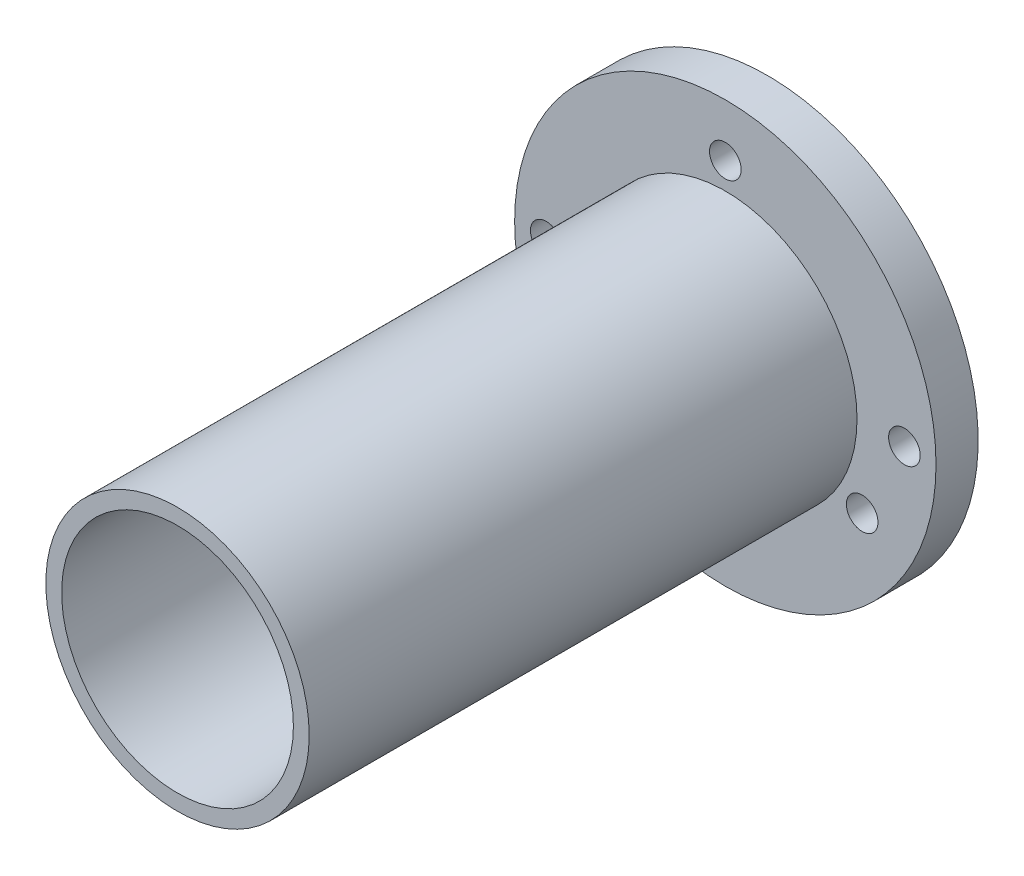
ISO-10303-21;
HEADER;
FILE_DESCRIPTION(('STEP AP214'),'2;1');
FILE_NAME('part.step','',(''),(''),'','','');
FILE_SCHEMA(('AUTOMOTIVE_DESIGN { 1 0 10303 214 1 1 1 1 }'));
ENDSEC;
DATA;
#1=APPLICATION_CONTEXT('core data for automotive mechanical design processes');
#2=APPLICATION_PROTOCOL_DEFINITION('international standard','automotive_design',2000,#1);
#3=PRODUCT_CONTEXT('',#1,'mechanical');
#4=PRODUCT('Part','Part','',(#3));
#5=PRODUCT_RELATED_PRODUCT_CATEGORY('part','',(#4));
#6=PRODUCT_DEFINITION_FORMATION('','',#4);
#7=PRODUCT_DEFINITION_CONTEXT('part definition',#1,'design');
#8=PRODUCT_DEFINITION('design','',#6,#7);
#9=PRODUCT_DEFINITION_SHAPE('','',#8);
#10=(LENGTH_UNIT() NAMED_UNIT(*) SI_UNIT(.MILLI.,.METRE.));
#11=(NAMED_UNIT(*) PLANE_ANGLE_UNIT() SI_UNIT($,.RADIAN.));
#12=(NAMED_UNIT(*) SI_UNIT($,.STERADIAN.) SOLID_ANGLE_UNIT());
#13=UNCERTAINTY_MEASURE_WITH_UNIT(LENGTH_MEASURE(1.E-05),#10,'distance_accuracy_value','');
#14=(GEOMETRIC_REPRESENTATION_CONTEXT(3) GLOBAL_UNCERTAINTY_ASSIGNED_CONTEXT((#13)) GLOBAL_UNIT_ASSIGNED_CONTEXT((#10,
#11,#12)) REPRESENTATION_CONTEXT('',''));
#15=CARTESIAN_POINT('',(0.,0.,0.));
#16=DIRECTION('',(0.,0.,1.));
#17=DIRECTION('',(1.,0.,0.));
#18=AXIS2_PLACEMENT_3D('',#15,#16,#17);
#19=CARTESIAN_POINT('',(0.,0.,2.));
#20=DIRECTION('',(0.,0.,-1.));
#21=DIRECTION('',(-1.,0.,0.));
#22=AXIS2_PLACEMENT_3D('',#19,#20,#21);
#23=CYLINDRICAL_SURFACE('',#22,10.);
#24=CARTESIAN_POINT('',(0.,0.,2.));
#25=DIRECTION('',(0.,0.,1.));
#26=DIRECTION('',(1.,0.,0.));
#27=AXIS2_PLACEMENT_3D('',#24,#25,#26);
#28=CIRCLE('',#27,10.);
#29=CARTESIAN_POINT('',(10.,0.,2.));
#30=VERTEX_POINT('',#29);
#31=EDGE_CURVE('E10',#30,#30,#28,.T.);
#32=ORIENTED_EDGE('',*,*,#31,.F.);
#33=EDGE_LOOP('',(#32));
#34=FACE_BOUND('',#33,.T.);
#35=CARTESIAN_POINT('',(0.,0.,0.));
#36=DIRECTION('',(0.,0.,-1.));
#37=DIRECTION('',(-1.,0.,0.));
#38=AXIS2_PLACEMENT_3D('',#35,#36,#37);
#39=CIRCLE('',#38,10.);
#40=CARTESIAN_POINT('',(-10.,0.,0.));
#41=VERTEX_POINT('',#40);
#42=EDGE_CURVE('E51',#41,#41,#39,.T.);
#43=ORIENTED_EDGE('',*,*,#42,.F.);
#44=EDGE_LOOP('',(#43));
#45=FACE_BOUND('',#44,.T.);
#46=ADVANCED_FACE('F33',(#34,#45),#23,.T.);
#47=CARTESIAN_POINT('',(-8.5,0.,2.001));
#48=DIRECTION('',(0.,0.,-1.));
#49=DIRECTION('',(-1.,0.,0.));
#50=AXIS2_PLACEMENT_3D('',#47,#48,#49);
#51=CYLINDRICAL_SURFACE('',#50,0.75);
#52=CARTESIAN_POINT('',(-8.5,0.,2.));
#53=DIRECTION('',(0.,0.,1.));
#54=DIRECTION('',(1.,0.,0.));
#55=AXIS2_PLACEMENT_3D('',#52,#53,#54);
#56=CIRCLE('',#55,0.75);
#57=CARTESIAN_POINT('',(-7.75,0.,2.));
#58=VERTEX_POINT('',#57);
#59=EDGE_CURVE('E44',#58,#58,#56,.F.);
#60=ORIENTED_EDGE('',*,*,#59,.F.);
#61=EDGE_LOOP('',(#60));
#62=FACE_BOUND('',#61,.T.);
#63=CARTESIAN_POINT('',(-8.5,0.,0.));
#64=DIRECTION('',(0.,0.,-1.));
#65=DIRECTION('',(-1.,0.,0.));
#66=AXIS2_PLACEMENT_3D('',#63,#64,#65);
#67=CIRCLE('',#66,0.75);
#68=CARTESIAN_POINT('',(-9.25,0.,0.));
#69=VERTEX_POINT('',#68);
#70=EDGE_CURVE('E73',#69,#69,#67,.F.);
#71=ORIENTED_EDGE('',*,*,#70,.F.);
#72=EDGE_LOOP('',(#71));
#73=FACE_BOUND('',#72,.T.);
#74=ADVANCED_FACE('F110',(#62,#73),#51,.F.);
#75=CARTESIAN_POINT('',(8.5,0.,2.001));
#76=DIRECTION('',(0.,0.,-1.));
#77=DIRECTION('',(-1.,0.,0.));
#78=AXIS2_PLACEMENT_3D('',#75,#76,#77);
#79=CYLINDRICAL_SURFACE('',#78,0.75);
#80=CARTESIAN_POINT('',(8.5,0.,2.));
#81=DIRECTION('',(0.,0.,1.));
#82=DIRECTION('',(1.,0.,0.));
#83=AXIS2_PLACEMENT_3D('',#80,#81,#82);
#84=CIRCLE('',#83,0.75);
#85=CARTESIAN_POINT('',(9.25,0.,2.));
#86=VERTEX_POINT('',#85);
#87=EDGE_CURVE('E40',#86,#86,#84,.F.);
#88=ORIENTED_EDGE('',*,*,#87,.F.);
#89=EDGE_LOOP('',(#88));
#90=FACE_BOUND('',#89,.T.);
#91=CARTESIAN_POINT('',(8.5,0.,0.));
#92=DIRECTION('',(0.,0.,-1.));
#93=DIRECTION('',(-1.,0.,0.));
#94=AXIS2_PLACEMENT_3D('',#91,#92,#93);
#95=CIRCLE('',#94,0.75);
#96=CARTESIAN_POINT('',(7.75,0.,0.));
#97=VERTEX_POINT('',#96);
#98=EDGE_CURVE('E76',#97,#97,#95,.F.);
#99=ORIENTED_EDGE('',*,*,#98,.F.);
#100=EDGE_LOOP('',(#99));
#101=FACE_BOUND('',#100,.T.);
#102=ADVANCED_FACE('F115',(#90,#101),#79,.F.);
#103=CARTESIAN_POINT('',(6.49519052838287,-3.75000000000083,28.001));
#104=DIRECTION('',(0.,0.,-1.));
#105=DIRECTION('',(-1.,0.,0.));
#106=AXIS2_PLACEMENT_3D('',#103,#104,#105);
#107=CYLINDRICAL_SURFACE('',#106,0.749999999999998);
#108=CARTESIAN_POINT('',(6.49519052838287,-3.75000000000083,2.));
#109=DIRECTION('',(0.,0.,1.));
#110=DIRECTION('',(1.,0.,0.));
#111=AXIS2_PLACEMENT_3D('',#108,#109,#110);
#112=CIRCLE('',#111,0.749999999999998);
#113=CARTESIAN_POINT('',(7.24519052838287,-3.75000000000083,2.));
#114=VERTEX_POINT('',#113);
#115=EDGE_CURVE('E50',#114,#114,#112,.F.);
#116=ORIENTED_EDGE('',*,*,#115,.F.);
#117=EDGE_LOOP('',(#116));
#118=FACE_BOUND('',#117,.T.);
#119=CARTESIAN_POINT('',(6.49519052838287,-3.75000000000083,0.));
#120=DIRECTION('',(0.,0.,-1.));
#121=DIRECTION('',(-1.,0.,0.));
#122=AXIS2_PLACEMENT_3D('',#119,#120,#121);
#123=CIRCLE('',#122,0.749999999999998);
#124=CARTESIAN_POINT('',(5.74519052838287,-3.75000000000083,0.));
#125=VERTEX_POINT('',#124);
#126=EDGE_CURVE('E79',#125,#125,#123,.F.);
#127=ORIENTED_EDGE('',*,*,#126,.F.);
#128=EDGE_LOOP('',(#127));
#129=FACE_BOUND('',#128,.T.);
#130=ADVANCED_FACE('F104',(#118,#129),#107,.F.);
#131=CARTESIAN_POINT('',(-6.49519052838421,-3.75000000000005,28.001));
#132=DIRECTION('',(0.,0.,-1.));
#133=DIRECTION('',(-1.,0.,0.));
#134=AXIS2_PLACEMENT_3D('',#131,#132,#133);
#135=CYLINDRICAL_SURFACE('',#134,0.750000000000001);
#136=CARTESIAN_POINT('',(-6.49519052838421,-3.75000000000005,2.));
#137=DIRECTION('',(0.,0.,1.));
#138=DIRECTION('',(1.,0.,0.));
#139=AXIS2_PLACEMENT_3D('',#136,#137,#138);
#140=CIRCLE('',#139,0.750000000000001);
#141=CARTESIAN_POINT('',(-5.74519052838421,-3.75000000000005,2.));
#142=VERTEX_POINT('',#141);
#143=EDGE_CURVE('E66',#142,#142,#140,.F.);
#144=ORIENTED_EDGE('',*,*,#143,.F.);
#145=EDGE_LOOP('',(#144));
#146=FACE_BOUND('',#145,.T.);
#147=CARTESIAN_POINT('',(-6.49519052838421,-3.75000000000005,0.));
#148=DIRECTION('',(0.,0.,-1.));
#149=DIRECTION('',(-1.,0.,0.));
#150=AXIS2_PLACEMENT_3D('',#147,#148,#149);
#151=CIRCLE('',#150,0.750000000000001);
#152=CARTESIAN_POINT('',(-7.24519052838422,-3.75000000000005,0.));
#153=VERTEX_POINT('',#152);
#154=EDGE_CURVE('E82',#153,#153,#151,.F.);
#155=ORIENTED_EDGE('',*,*,#154,.F.);
#156=EDGE_LOOP('',(#155));
#157=FACE_BOUND('',#156,.T.);
#158=ADVANCED_FACE('F95',(#146,#157),#135,.F.);
#159=CARTESIAN_POINT('',(0.,7.5,28.001));
#160=DIRECTION('',(0.,0.,-1.));
#161=DIRECTION('',(-1.,0.,0.));
#162=AXIS2_PLACEMENT_3D('',#159,#160,#161);
#163=CYLINDRICAL_SURFACE('',#162,0.749999999999999);
#164=CARTESIAN_POINT('',(0.,7.5,2.));
#165=DIRECTION('',(0.,0.,1.));
#166=DIRECTION('',(1.,0.,0.));
#167=AXIS2_PLACEMENT_3D('',#164,#165,#166);
#168=CIRCLE('',#167,0.749999999999999);
#169=CARTESIAN_POINT('',(0.749999999999999,7.5,2.));
#170=VERTEX_POINT('',#169);
#171=EDGE_CURVE('E63',#170,#170,#168,.F.);
#172=ORIENTED_EDGE('',*,*,#171,.F.);
#173=EDGE_LOOP('',(#172));
#174=FACE_BOUND('',#173,.T.);
#175=CARTESIAN_POINT('',(0.,7.5,0.));
#176=DIRECTION('',(0.,0.,-1.));
#177=DIRECTION('',(-1.,0.,0.));
#178=AXIS2_PLACEMENT_3D('',#175,#176,#177);
#179=CIRCLE('',#178,0.749999999999999);
#180=CARTESIAN_POINT('',(-0.749999999999999,7.5,0.));
#181=VERTEX_POINT('',#180);
#182=EDGE_CURVE('E36',#181,#181,#179,.F.);
#183=ORIENTED_EDGE('',*,*,#182,.F.);
#184=EDGE_LOOP('',(#183));
#185=FACE_BOUND('',#184,.T.);
#186=ADVANCED_FACE('F92',(#174,#185),#163,.F.);
#187=CARTESIAN_POINT('',(0.,0.,2.));
#188=DIRECTION('',(0.,0.,1.));
#189=DIRECTION('',(1.,0.,0.));
#190=AXIS2_PLACEMENT_3D('',#187,#188,#189);
#191=PLANE('',#190);
#192=ORIENTED_EDGE('',*,*,#171,.T.);
#193=EDGE_LOOP('',(#192));
#194=FACE_BOUND('',#193,.T.);
#195=ORIENTED_EDGE('',*,*,#143,.T.);
#196=EDGE_LOOP('',(#195));
#197=FACE_BOUND('',#196,.T.);
#198=ORIENTED_EDGE('',*,*,#115,.T.);
#199=EDGE_LOOP('',(#198));
#200=FACE_BOUND('',#199,.T.);
#201=ORIENTED_EDGE('',*,*,#31,.T.);
#202=EDGE_LOOP('',(#201));
#203=FACE_BOUND('',#202,.T.);
#204=ORIENTED_EDGE('',*,*,#59,.T.);
#205=EDGE_LOOP('',(#204));
#206=FACE_BOUND('',#205,.T.);
#207=ORIENTED_EDGE('',*,*,#87,.T.);
#208=EDGE_LOOP('',(#207));
#209=FACE_BOUND('',#208,.T.);
#210=CARTESIAN_POINT('',(0.,0.,2.));
#211=DIRECTION('',(0.,0.,1.));
#212=DIRECTION('',(1.,0.,0.));
#213=AXIS2_PLACEMENT_3D('',#210,#211,#212);
#214=CIRCLE('',#213,6.25);
#215=CARTESIAN_POINT('',(6.25,0.,2.));
#216=VERTEX_POINT('',#215);
#217=EDGE_CURVE('E55',#216,#216,#214,.T.);
#218=ORIENTED_EDGE('',*,*,#217,.F.);
#219=EDGE_LOOP('',(#218));
#220=FACE_BOUND('',#219,.T.);
#221=ADVANCED_FACE('F94',(#194,#197,#200,#203,#206,#209,#220),#191,.T.);
#222=CARTESIAN_POINT('',(0.,0.,28.));
#223=DIRECTION('',(0.,0.,1.));
#224=DIRECTION('',(1.,0.,0.));
#225=AXIS2_PLACEMENT_3D('',#222,#223,#224);
#226=PLANE('',#225);
#227=CARTESIAN_POINT('',(0.,0.,28.));
#228=DIRECTION('',(0.,0.,1.));
#229=DIRECTION('',(1.,0.,0.));
#230=AXIS2_PLACEMENT_3D('',#227,#228,#229);
#231=CIRCLE('',#230,6.25);
#232=CARTESIAN_POINT('',(6.25,0.,28.));
#233=VERTEX_POINT('',#232);
#234=EDGE_CURVE('E53',#233,#233,#231,.T.);
#235=ORIENTED_EDGE('',*,*,#234,.T.);
#236=EDGE_LOOP('',(#235));
#237=FACE_BOUND('',#236,.T.);
#238=CARTESIAN_POINT('',(0.,0.,28.));
#239=DIRECTION('',(0.,0.,1.));
#240=DIRECTION('',(1.,0.,0.));
#241=AXIS2_PLACEMENT_3D('',#238,#239,#240);
#242=CIRCLE('',#241,5.5);
#243=CARTESIAN_POINT('',(5.5,0.,28.));
#244=VERTEX_POINT('',#243);
#245=EDGE_CURVE('E58',#244,#244,#242,.T.);
#246=ORIENTED_EDGE('',*,*,#245,.F.);
#247=EDGE_LOOP('',(#246));
#248=FACE_BOUND('',#247,.T.);
#249=ADVANCED_FACE('F102',(#237,#248),#226,.T.);
#250=CARTESIAN_POINT('',(0.,0.,28.));
#251=DIRECTION('',(0.,0.,-1.));
#252=DIRECTION('',(-1.,0.,0.));
#253=AXIS2_PLACEMENT_3D('',#250,#251,#252);
#254=CYLINDRICAL_SURFACE('',#253,6.25);
#255=ORIENTED_EDGE('',*,*,#234,.F.);
#256=EDGE_LOOP('',(#255));
#257=FACE_BOUND('',#256,.T.);
#258=ORIENTED_EDGE('',*,*,#217,.T.);
#259=EDGE_LOOP('',(#258));
#260=FACE_BOUND('',#259,.T.);
#261=ADVANCED_FACE('F128',(#257,#260),#254,.T.);
#262=CARTESIAN_POINT('',(0.,0.,2.));
#263=DIRECTION('',(0.,0.,-1.));
#264=DIRECTION('',(-1.,0.,0.));
#265=AXIS2_PLACEMENT_3D('',#262,#263,#264);
#266=CYLINDRICAL_SURFACE('',#265,5.5);
#267=CARTESIAN_POINT('',(0.,0.,0.));
#268=DIRECTION('',(0.,0.,1.));
#269=DIRECTION('',(1.,0.,0.));
#270=AXIS2_PLACEMENT_3D('',#267,#268,#269);
#271=CIRCLE('',#270,5.5);
#272=CARTESIAN_POINT('',(5.5,0.,0.));
#273=VERTEX_POINT('',#272);
#274=EDGE_CURVE('E47',#273,#273,#271,.T.);
#275=ORIENTED_EDGE('',*,*,#274,.F.);
#276=EDGE_LOOP('',(#275));
#277=FACE_BOUND('',#276,.T.);
#278=ORIENTED_EDGE('',*,*,#245,.T.);
#279=EDGE_LOOP('',(#278));
#280=FACE_BOUND('',#279,.T.);
#281=ADVANCED_FACE('F122',(#277,#280),#266,.F.);
#282=CARTESIAN_POINT('',(0.,0.,0.));
#283=DIRECTION('',(0.,0.,-1.));
#284=DIRECTION('',(-1.,0.,0.));
#285=AXIS2_PLACEMENT_3D('',#282,#283,#284);
#286=PLANE('',#285);
#287=ORIENTED_EDGE('',*,*,#70,.T.);
#288=EDGE_LOOP('',(#287));
#289=FACE_BOUND('',#288,.T.);
#290=ORIENTED_EDGE('',*,*,#98,.T.);
#291=EDGE_LOOP('',(#290));
#292=FACE_BOUND('',#291,.T.);
#293=ORIENTED_EDGE('',*,*,#126,.T.);
#294=EDGE_LOOP('',(#293));
#295=FACE_BOUND('',#294,.T.);
#296=ORIENTED_EDGE('',*,*,#154,.T.);
#297=EDGE_LOOP('',(#296));
#298=FACE_BOUND('',#297,.T.);
#299=ORIENTED_EDGE('',*,*,#182,.T.);
#300=EDGE_LOOP('',(#299));
#301=FACE_BOUND('',#300,.T.);
#302=ORIENTED_EDGE('',*,*,#42,.T.);
#303=EDGE_LOOP('',(#302));
#304=FACE_BOUND('',#303,.T.);
#305=ORIENTED_EDGE('',*,*,#274,.T.);
#306=EDGE_LOOP('',(#305));
#307=FACE_BOUND('',#306,.T.);
#308=ADVANCED_FACE('F89',(#289,#292,#295,#298,#301,#304,#307),#286,.T.);
#309=CLOSED_SHELL('',(#46,#74,#102,#130,#158,#186,#221,#249,#261,#281,#308));
#310=MANIFOLD_SOLID_BREP('B2',#309);
#311=ADVANCED_BREP_SHAPE_REPRESENTATION('',(#18,#310),#14);
#312=SHAPE_DEFINITION_REPRESENTATION(#9,#311);
ENDSEC;
END-ISO-10303-21;
